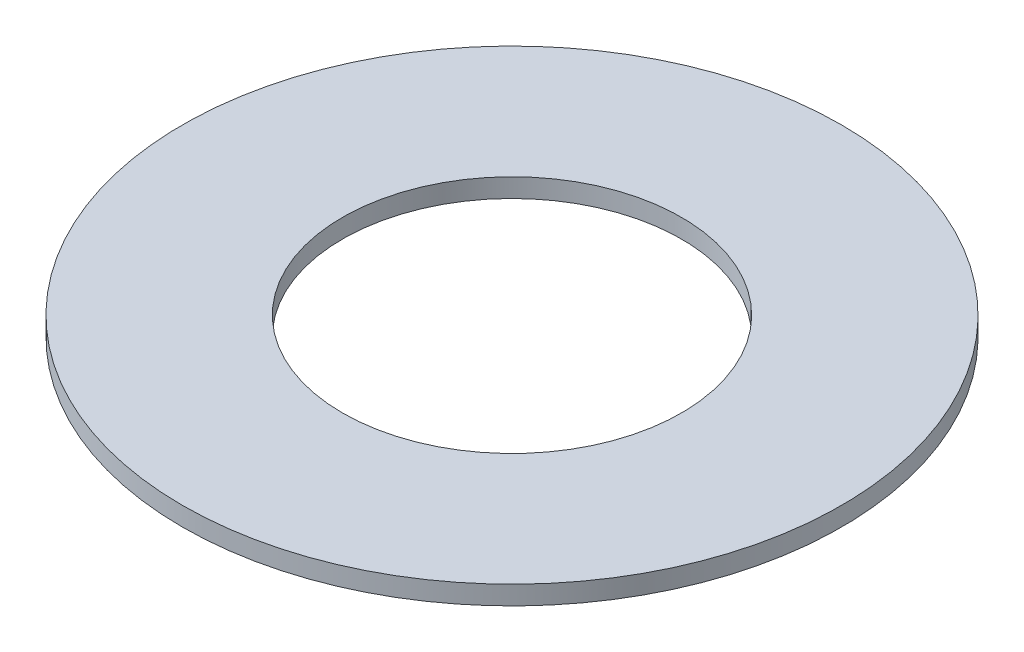
ISO-10303-21;
HEADER;
FILE_DESCRIPTION(('STEP AP214'),'2;1');
FILE_NAME('part.step','',(''),(''),'','','');
FILE_SCHEMA(('AUTOMOTIVE_DESIGN { 1 0 10303 214 1 1 1 1 }'));
ENDSEC;
DATA;
#1=APPLICATION_CONTEXT('core data for automotive mechanical design processes');
#2=APPLICATION_PROTOCOL_DEFINITION('international standard','automotive_design',2000,#1);
#3=PRODUCT_CONTEXT('',#1,'mechanical');
#4=PRODUCT('Part','Part','',(#3));
#5=PRODUCT_RELATED_PRODUCT_CATEGORY('part','',(#4));
#6=PRODUCT_DEFINITION_FORMATION('','',#4);
#7=PRODUCT_DEFINITION_CONTEXT('part definition',#1,'design');
#8=PRODUCT_DEFINITION('design','',#6,#7);
#9=PRODUCT_DEFINITION_SHAPE('','',#8);
#10=(LENGTH_UNIT() NAMED_UNIT(*) SI_UNIT(.MILLI.,.METRE.));
#11=(NAMED_UNIT(*) PLANE_ANGLE_UNIT() SI_UNIT($,.RADIAN.));
#12=(NAMED_UNIT(*) SI_UNIT($,.STERADIAN.) SOLID_ANGLE_UNIT());
#13=UNCERTAINTY_MEASURE_WITH_UNIT(LENGTH_MEASURE(1.E-05),#10,'distance_accuracy_value','');
#14=(GEOMETRIC_REPRESENTATION_CONTEXT(3) GLOBAL_UNCERTAINTY_ASSIGNED_CONTEXT((#13)) GLOBAL_UNIT_ASSIGNED_CONTEXT((#10,
#11,#12)) REPRESENTATION_CONTEXT('',''));
#15=CARTESIAN_POINT('',(0.,0.,0.));
#16=DIRECTION('',(0.,0.,1.));
#17=DIRECTION('',(1.,0.,0.));
#18=AXIS2_PLACEMENT_3D('',#15,#16,#17);
#19=CARTESIAN_POINT('',(0.,5.,0.));
#20=DIRECTION('',(0.,-1.,0.));
#21=DIRECTION('',(0.,0.,-1.));
#22=AXIS2_PLACEMENT_3D('',#19,#20,#21);
#23=CYLINDRICAL_SURFACE('',#22,87.5);
#24=CARTESIAN_POINT('',(0.,5.,0.));
#25=DIRECTION('',(0.,1.,0.));
#26=DIRECTION('',(0.,0.,1.));
#27=AXIS2_PLACEMENT_3D('',#24,#25,#26);
#28=CIRCLE('',#27,87.5);
#29=CARTESIAN_POINT('',(0.,5.,87.5));
#30=VERTEX_POINT('',#29);
#31=EDGE_CURVE('E10',#30,#30,#28,.T.);
#32=ORIENTED_EDGE('',*,*,#31,.F.);
#33=EDGE_LOOP('',(#32));
#34=FACE_BOUND('',#33,.T.);
#35=CARTESIAN_POINT('',(0.,0.,0.));
#36=DIRECTION('',(0.,1.,0.));
#37=DIRECTION('',(0.,0.,1.));
#38=AXIS2_PLACEMENT_3D('',#35,#36,#37);
#39=CIRCLE('',#38,87.5);
#40=CARTESIAN_POINT('',(0.,0.,87.5));
#41=VERTEX_POINT('',#40);
#42=EDGE_CURVE('E37',#41,#41,#39,.T.);
#43=ORIENTED_EDGE('',*,*,#42,.T.);
#44=EDGE_LOOP('',(#43));
#45=FACE_BOUND('',#44,.T.);
#46=ADVANCED_FACE('F40',(#34,#45),#23,.T.);
#47=CARTESIAN_POINT('',(0.,5.,0.));
#48=DIRECTION('',(0.,1.,0.));
#49=DIRECTION('',(0.,0.,1.));
#50=AXIS2_PLACEMENT_3D('',#47,#48,#49);
#51=PLANE('',#50);
#52=CARTESIAN_POINT('',(0.,5.,0.));
#53=DIRECTION('',(0.,1.,0.));
#54=DIRECTION('',(0.,0.,1.));
#55=AXIS2_PLACEMENT_3D('',#52,#53,#54);
#56=CIRCLE('',#55,45.);
#57=CARTESIAN_POINT('',(0.,5.,45.));
#58=VERTEX_POINT('',#57);
#59=EDGE_CURVE('E50',#58,#58,#56,.T.);
#60=ORIENTED_EDGE('',*,*,#59,.F.);
#61=EDGE_LOOP('',(#60));
#62=FACE_BOUND('',#61,.T.);
#63=ORIENTED_EDGE('',*,*,#31,.T.);
#64=EDGE_LOOP('',(#63));
#65=FACE_BOUND('',#64,.T.);
#66=ADVANCED_FACE('F59',(#62,#65),#51,.T.);
#67=CARTESIAN_POINT('',(0.,0.,0.));
#68=DIRECTION('',(0.,1.,0.));
#69=DIRECTION('',(0.,0.,1.));
#70=AXIS2_PLACEMENT_3D('',#67,#68,#69);
#71=PLANE('',#70);
#72=CARTESIAN_POINT('',(0.,0.,0.));
#73=DIRECTION('',(0.,1.,0.));
#74=DIRECTION('',(0.,0.,1.));
#75=AXIS2_PLACEMENT_3D('',#72,#73,#74);
#76=CIRCLE('',#75,45.);
#77=CARTESIAN_POINT('',(0.,0.,45.));
#78=VERTEX_POINT('',#77);
#79=EDGE_CURVE('E47',#78,#78,#76,.T.);
#80=ORIENTED_EDGE('',*,*,#79,.T.);
#81=EDGE_LOOP('',(#80));
#82=FACE_BOUND('',#81,.T.);
#83=ORIENTED_EDGE('',*,*,#42,.F.);
#84=EDGE_LOOP('',(#83));
#85=FACE_BOUND('',#84,.T.);
#86=ADVANCED_FACE('F58',(#82,#85),#71,.F.);
#87=CARTESIAN_POINT('',(0.,5.,0.));
#88=DIRECTION('',(0.,-1.,0.));
#89=DIRECTION('',(0.,0.,-1.));
#90=AXIS2_PLACEMENT_3D('',#87,#88,#89);
#91=CYLINDRICAL_SURFACE('',#90,45.);
#92=ORIENTED_EDGE('',*,*,#59,.T.);
#93=EDGE_LOOP('',(#92));
#94=FACE_BOUND('',#93,.T.);
#95=ORIENTED_EDGE('',*,*,#79,.F.);
#96=EDGE_LOOP('',(#95));
#97=FACE_BOUND('',#96,.T.);
#98=ADVANCED_FACE('F54',(#94,#97),#91,.F.);
#99=CLOSED_SHELL('',(#46,#66,#86,#98));
#100=MANIFOLD_SOLID_BREP('B2',#99);
#101=ADVANCED_BREP_SHAPE_REPRESENTATION('',(#18,#100),#14);
#102=SHAPE_DEFINITION_REPRESENTATION(#9,#101);
ENDSEC;
END-ISO-10303-21;
